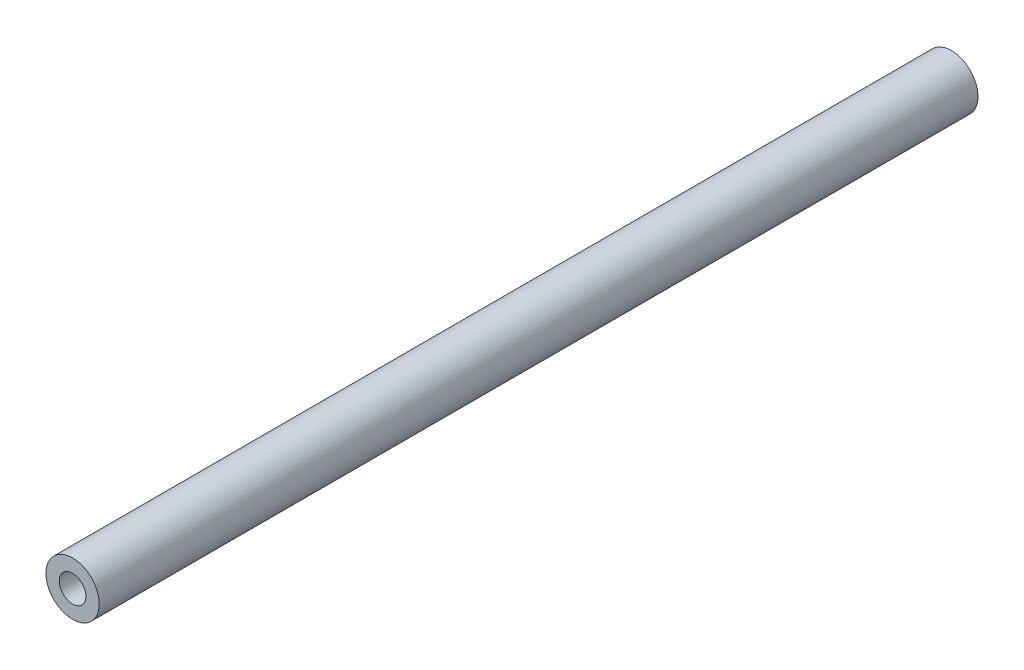
ISO-10303-21;
HEADER;
FILE_DESCRIPTION(('STEP AP214'),'2;1');
FILE_NAME('part.step','',(''),(''),'','','');
FILE_SCHEMA(('AUTOMOTIVE_DESIGN { 1 0 10303 214 1 1 1 1 }'));
ENDSEC;
DATA;
#1=APPLICATION_CONTEXT('core data for automotive mechanical design processes');
#2=APPLICATION_PROTOCOL_DEFINITION('international standard','automotive_design',2000,#1);
#3=PRODUCT_CONTEXT('',#1,'mechanical');
#4=PRODUCT('Part','Part','',(#3));
#5=PRODUCT_RELATED_PRODUCT_CATEGORY('part','',(#4));
#6=PRODUCT_DEFINITION_FORMATION('','',#4);
#7=PRODUCT_DEFINITION_CONTEXT('part definition',#1,'design');
#8=PRODUCT_DEFINITION('design','',#6,#7);
#9=PRODUCT_DEFINITION_SHAPE('','',#8);
#10=(LENGTH_UNIT() NAMED_UNIT(*) SI_UNIT(.MILLI.,.METRE.));
#11=(NAMED_UNIT(*) PLANE_ANGLE_UNIT() SI_UNIT($,.RADIAN.));
#12=(NAMED_UNIT(*) SI_UNIT($,.STERADIAN.) SOLID_ANGLE_UNIT());
#13=UNCERTAINTY_MEASURE_WITH_UNIT(LENGTH_MEASURE(1.E-05),#10,'distance_accuracy_value','');
#14=(GEOMETRIC_REPRESENTATION_CONTEXT(3) GLOBAL_UNCERTAINTY_ASSIGNED_CONTEXT((#13)) GLOBAL_UNIT_ASSIGNED_CONTEXT((#10,
#11,#12)) REPRESENTATION_CONTEXT('',''));
#15=CARTESIAN_POINT('',(0.,0.,0.));
#16=DIRECTION('',(0.,0.,1.));
#17=DIRECTION('',(1.,0.,0.));
#18=AXIS2_PLACEMENT_3D('',#15,#16,#17);
#19=CARTESIAN_POINT('',(0.,0.,104.775));
#20=DIRECTION('',(0.,0.,-1.));
#21=DIRECTION('',(-1.,0.,0.));
#22=AXIS2_PLACEMENT_3D('',#19,#20,#21);
#23=CYLINDRICAL_SURFACE('',#22,6.35);
#24=CARTESIAN_POINT('',(0.,0.,104.775));
#25=DIRECTION('',(0.,0.,1.));
#26=DIRECTION('',(1.,0.,0.));
#27=AXIS2_PLACEMENT_3D('',#24,#25,#26);
#28=CIRCLE('',#27,6.35);
#29=CARTESIAN_POINT('',(6.35,0.,104.775));
#30=VERTEX_POINT('',#29);
#31=EDGE_CURVE('E10',#30,#30,#28,.T.);
#32=ORIENTED_EDGE('',*,*,#31,.F.);
#33=EDGE_LOOP('',(#32));
#34=FACE_BOUND('',#33,.T.);
#35=CARTESIAN_POINT('',(0.,0.,-104.775));
#36=DIRECTION('',(0.,0.,1.));
#37=DIRECTION('',(1.,0.,0.));
#38=AXIS2_PLACEMENT_3D('',#35,#36,#37);
#39=CIRCLE('',#38,6.35);
#40=CARTESIAN_POINT('',(6.35,0.,-104.775));
#41=VERTEX_POINT('',#40);
#42=EDGE_CURVE('E35',#41,#41,#39,.T.);
#43=ORIENTED_EDGE('',*,*,#42,.T.);
#44=EDGE_LOOP('',(#43));
#45=FACE_BOUND('',#44,.T.);
#46=ADVANCED_FACE('F32',(#34,#45),#23,.T.);
#47=CARTESIAN_POINT('',(0.,0.,104.775));
#48=DIRECTION('',(0.,0.,1.));
#49=DIRECTION('',(1.,0.,0.));
#50=AXIS2_PLACEMENT_3D('',#47,#48,#49);
#51=PLANE('',#50);
#52=CARTESIAN_POINT('',(0.,0.,104.775));
#53=DIRECTION('',(0.,0.,1.));
#54=DIRECTION('',(1.,0.,0.));
#55=AXIS2_PLACEMENT_3D('',#52,#53,#54);
#56=CIRCLE('',#55,3.175);
#57=CARTESIAN_POINT('',(3.175,0.,104.775));
#58=VERTEX_POINT('',#57);
#59=EDGE_CURVE('E50',#58,#58,#56,.T.);
#60=ORIENTED_EDGE('',*,*,#59,.F.);
#61=EDGE_LOOP('',(#60));
#62=FACE_BOUND('',#61,.T.);
#63=ORIENTED_EDGE('',*,*,#31,.T.);
#64=EDGE_LOOP('',(#63));
#65=FACE_BOUND('',#64,.T.);
#66=ADVANCED_FACE('F65',(#62,#65),#51,.T.);
#67=CARTESIAN_POINT('',(0.,0.,-104.775));
#68=DIRECTION('',(0.,0.,1.));
#69=DIRECTION('',(1.,0.,0.));
#70=AXIS2_PLACEMENT_3D('',#67,#68,#69);
#71=PLANE('',#70);
#72=CARTESIAN_POINT('',(0.,0.,-104.775));
#73=DIRECTION('',(0.,0.,-1.));
#74=DIRECTION('',(-1.,0.,0.));
#75=AXIS2_PLACEMENT_3D('',#72,#73,#74);
#76=CIRCLE('',#75,3.175);
#77=CARTESIAN_POINT('',(-3.175,0.,-104.775));
#78=VERTEX_POINT('',#77);
#79=EDGE_CURVE('E44',#78,#78,#76,.T.);
#80=ORIENTED_EDGE('',*,*,#79,.F.);
#81=EDGE_LOOP('',(#80));
#82=FACE_BOUND('',#81,.T.);
#83=ORIENTED_EDGE('',*,*,#42,.F.);
#84=EDGE_LOOP('',(#83));
#85=FACE_BOUND('',#84,.T.);
#86=ADVANCED_FACE('F67',(#82,#85),#71,.F.);
#87=CARTESIAN_POINT('',(0.,0.,-85.725));
#88=DIRECTION('',(0.,0.,-1.));
#89=DIRECTION('',(-1.,0.,0.));
#90=AXIS2_PLACEMENT_3D('',#87,#88,#89);
#91=CYLINDRICAL_SURFACE('',#90,3.175);
#92=CARTESIAN_POINT('',(0.,0.,-85.725));
#93=DIRECTION('',(0.,0.,-1.));
#94=DIRECTION('',(-1.,0.,0.));
#95=AXIS2_PLACEMENT_3D('',#92,#93,#94);
#96=CIRCLE('',#95,3.175);
#97=CARTESIAN_POINT('',(-3.175,0.,-85.725));
#98=VERTEX_POINT('',#97);
#99=EDGE_CURVE('E42',#98,#98,#96,.T.);
#100=ORIENTED_EDGE('',*,*,#99,.F.);
#101=EDGE_LOOP('',(#100));
#102=FACE_BOUND('',#101,.T.);
#103=ORIENTED_EDGE('',*,*,#79,.T.);
#104=EDGE_LOOP('',(#103));
#105=FACE_BOUND('',#104,.T.);
#106=ADVANCED_FACE('F73',(#102,#105),#91,.F.);
#107=CARTESIAN_POINT('',(0.,0.,-85.725));
#108=DIRECTION('',(0.,0.,-1.));
#109=DIRECTION('',(-1.,0.,0.));
#110=AXIS2_PLACEMENT_3D('',#107,#108,#109);
#111=PLANE('',#110);
#112=ORIENTED_EDGE('',*,*,#99,.T.);
#113=EDGE_LOOP('',(#112));
#114=FACE_BOUND('',#113,.T.);
#115=ADVANCED_FACE('F61',(#114),#111,.T.);
#116=CARTESIAN_POINT('',(0.,0.,85.725));
#117=DIRECTION('',(0.,0.,1.));
#118=DIRECTION('',(1.,0.,0.));
#119=AXIS2_PLACEMENT_3D('',#116,#117,#118);
#120=CYLINDRICAL_SURFACE('',#119,3.175);
#121=CARTESIAN_POINT('',(0.,0.,85.725));
#122=DIRECTION('',(0.,0.,1.));
#123=DIRECTION('',(1.,0.,0.));
#124=AXIS2_PLACEMENT_3D('',#121,#122,#123);
#125=CIRCLE('',#124,3.175);
#126=CARTESIAN_POINT('',(3.175,0.,85.725));
#127=VERTEX_POINT('',#126);
#128=EDGE_CURVE('E47',#127,#127,#125,.T.);
#129=ORIENTED_EDGE('',*,*,#128,.F.);
#130=EDGE_LOOP('',(#129));
#131=FACE_BOUND('',#130,.T.);
#132=ORIENTED_EDGE('',*,*,#59,.T.);
#133=EDGE_LOOP('',(#132));
#134=FACE_BOUND('',#133,.T.);
#135=ADVANCED_FACE('F58',(#131,#134),#120,.F.);
#136=CARTESIAN_POINT('',(0.,0.,85.725));
#137=DIRECTION('',(0.,0.,1.));
#138=DIRECTION('',(1.,0.,0.));
#139=AXIS2_PLACEMENT_3D('',#136,#137,#138);
#140=PLANE('',#139);
#141=ORIENTED_EDGE('',*,*,#128,.T.);
#142=EDGE_LOOP('',(#141));
#143=FACE_BOUND('',#142,.T.);
#144=ADVANCED_FACE('F56',(#143),#140,.T.);
#145=CLOSED_SHELL('',(#46,#66,#86,#106,#115,#135,#144));
#146=MANIFOLD_SOLID_BREP('B2',#145);
#147=ADVANCED_BREP_SHAPE_REPRESENTATION('',(#18,#146),#14);
#148=SHAPE_DEFINITION_REPRESENTATION(#9,#147);
ENDSEC;
END-ISO-10303-21;
